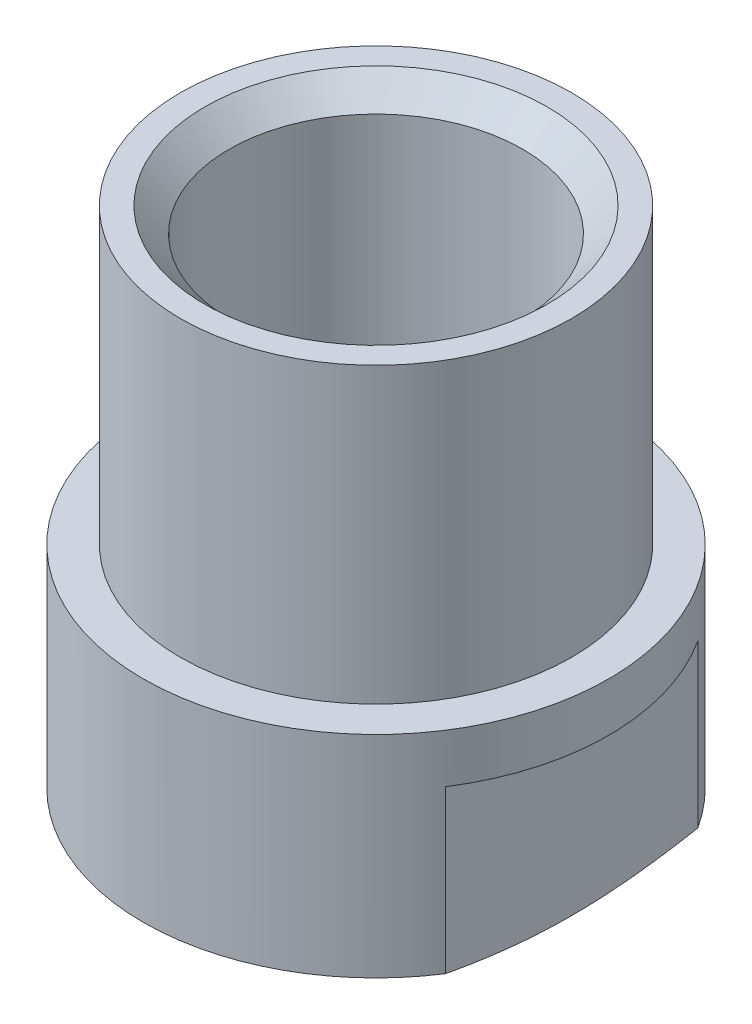
ISO-10303-21;
HEADER;
FILE_DESCRIPTION(('STEP AP214'),'2;1');
FILE_NAME('part.step','',(''),(''),'','','');
FILE_SCHEMA(('AUTOMOTIVE_DESIGN { 1 0 10303 214 1 1 1 1 }'));
ENDSEC;
DATA;
#1=APPLICATION_CONTEXT('core data for automotive mechanical design processes');
#2=APPLICATION_PROTOCOL_DEFINITION('international standard','automotive_design',2000,#1);
#3=PRODUCT_CONTEXT('',#1,'mechanical');
#4=PRODUCT('Part','Part','',(#3));
#5=PRODUCT_RELATED_PRODUCT_CATEGORY('part','',(#4));
#6=PRODUCT_DEFINITION_FORMATION('','',#4);
#7=PRODUCT_DEFINITION_CONTEXT('part definition',#1,'design');
#8=PRODUCT_DEFINITION('design','',#6,#7);
#9=PRODUCT_DEFINITION_SHAPE('','',#8);
#10=(LENGTH_UNIT() NAMED_UNIT(*) SI_UNIT(.MILLI.,.METRE.));
#11=(NAMED_UNIT(*) PLANE_ANGLE_UNIT() SI_UNIT($,.RADIAN.));
#12=(NAMED_UNIT(*) SI_UNIT($,.STERADIAN.) SOLID_ANGLE_UNIT());
#13=UNCERTAINTY_MEASURE_WITH_UNIT(LENGTH_MEASURE(1.E-05),#10,'distance_accuracy_value','');
#14=(GEOMETRIC_REPRESENTATION_CONTEXT(3) GLOBAL_UNCERTAINTY_ASSIGNED_CONTEXT((#13)) GLOBAL_UNIT_ASSIGNED_CONTEXT((#10,
#11,#12)) REPRESENTATION_CONTEXT('',''));
#15=CARTESIAN_POINT('',(0.,0.,0.));
#16=DIRECTION('',(0.,0.,1.));
#17=DIRECTION('',(1.,0.,0.));
#18=AXIS2_PLACEMENT_3D('',#15,#16,#17);
#19=CARTESIAN_POINT('',(0.,26.236559139785,0.));
#20=DIRECTION('',(0.,1.,0.));
#21=DIRECTION('',(0.,0.,1.));
#22=AXIS2_PLACEMENT_3D('',#19,#20,#21);
#23=CYLINDRICAL_SURFACE('',#22,4.76);
#24=CARTESIAN_POINT('',(0.,5.,0.));
#25=DIRECTION('',(0.,1.,0.));
#26=DIRECTION('',(0.,0.,1.));
#27=AXIS2_PLACEMENT_3D('',#24,#25,#26);
#28=CIRCLE('',#27,4.76);
#29=CARTESIAN_POINT('',(0.,5.,4.76));
#30=VERTEX_POINT('',#29);
#31=EDGE_CURVE('E171',#30,#30,#28,.T.);
#32=ORIENTED_EDGE('',*,*,#31,.F.);
#33=EDGE_LOOP('',(#32));
#34=FACE_BOUND('',#33,.T.);
#35=DIRECTION('',(0.,1.,0.));
#36=VECTOR('',#35,1.);
#37=CARTESIAN_POINT('',(4.,26.236559139785,-2.58023254765923));
#38=LINE('',#37,#36);
#39=CARTESIAN_POINT('',(4.,0.688655226579332,-2.58023254765923));
#40=VERTEX_POINT('',#39);
#41=CARTESIAN_POINT('',(4.,4.,-2.58023254765923));
#42=VERTEX_POINT('',#41);
#43=EDGE_CURVE('E212',#40,#42,#38,.T.);
#44=ORIENTED_EDGE('',*,*,#43,.F.);
#45=CARTESIAN_POINT('',(0.,0.688655226579332,0.));
#46=DIRECTION('',(0.,1.,0.));
#47=DIRECTION('',(0.,0.,1.));
#48=AXIS2_PLACEMENT_3D('',#45,#46,#47);
#49=CIRCLE('',#48,4.76);
#50=CARTESIAN_POINT('',(-4.,0.688655226579332,-2.58023254765923));
#51=VERTEX_POINT('',#50);
#52=EDGE_CURVE('E176',#40,#51,#49,.T.);
#53=ORIENTED_EDGE('',*,*,#52,.T.);
#54=DIRECTION('',(0.,1.,0.));
#55=VECTOR('',#54,1.);
#56=CARTESIAN_POINT('',(-4.,26.236559139785,-2.58023254765923));
#57=LINE('',#56,#55);
#58=CARTESIAN_POINT('',(-4.,4.,-2.58023254765923));
#59=VERTEX_POINT('',#58);
#60=EDGE_CURVE('E65',#59,#51,#57,.F.);
#61=ORIENTED_EDGE('',*,*,#60,.F.);
#62=CARTESIAN_POINT('',(0.,4.,0.));
#63=DIRECTION('',(0.,-1.,0.));
#64=DIRECTION('',(0.,0.,-1.));
#65=AXIS2_PLACEMENT_3D('',#62,#63,#64);
#66=CIRCLE('',#65,4.76);
#67=CARTESIAN_POINT('',(-4.,4.,2.58023254765923));
#68=VERTEX_POINT('',#67);
#69=EDGE_CURVE('E54',#68,#59,#66,.T.);
#70=ORIENTED_EDGE('',*,*,#69,.F.);
#71=DIRECTION('',(0.,1.,0.));
#72=VECTOR('',#71,1.);
#73=CARTESIAN_POINT('',(-4.,26.236559139785,2.58023254765923));
#74=LINE('',#73,#72);
#75=CARTESIAN_POINT('',(-4.,0.688655226579331,2.58023254765923));
#76=VERTEX_POINT('',#75);
#77=EDGE_CURVE('E90',#76,#68,#74,.T.);
#78=ORIENTED_EDGE('',*,*,#77,.F.);
#79=CARTESIAN_POINT('',(4.,0.688655226579332,2.58023254765923));
#80=VERTEX_POINT('',#79);
#81=EDGE_CURVE('E173',#76,#80,#49,.T.);
#82=ORIENTED_EDGE('',*,*,#81,.T.);
#83=DIRECTION('',(0.,1.,0.));
#84=VECTOR('',#83,1.);
#85=CARTESIAN_POINT('',(4.,26.236559139785,2.58023254765923));
#86=LINE('',#85,#84);
#87=CARTESIAN_POINT('',(4.,4.,2.58023254765923));
#88=VERTEX_POINT('',#87);
#89=EDGE_CURVE('E73',#88,#80,#86,.F.);
#90=ORIENTED_EDGE('',*,*,#89,.F.);
#91=EDGE_CURVE('E14',#42,#88,#66,.T.);
#92=ORIENTED_EDGE('',*,*,#91,.F.);
#93=EDGE_LOOP('',(#44,#53,#61,#70,#78,#82,#90,#92));
#94=FACE_BOUND('',#93,.T.);
#95=ADVANCED_FACE('F50',(#34,#94),#23,.T.);
#96=CARTESIAN_POINT('',(0.,0.688655226579332,0.));
#97=DIRECTION('',(0.,1.,0.));
#98=DIRECTION('',(0.,0.,1.));
#99=AXIS2_PLACEMENT_3D('',#96,#97,#98);
#100=CONICAL_SURFACE('',#99,4.76,1.23918376891598);
#101=CARTESIAN_POINT('',(0.,0.,0.));
#102=DIRECTION('',(0.,1.,0.));
#103=DIRECTION('',(0.,0.,1.));
#104=AXIS2_PLACEMENT_3D('',#101,#102,#103);
#105=CIRCLE('',#104,2.75999999999998);
#106=CARTESIAN_POINT('',(0.,0.,2.75999999999998));
#107=VERTEX_POINT('',#106);
#108=EDGE_CURVE('E183',#107,#107,#105,.F.);
#109=ORIENTED_EDGE('',*,*,#108,.F.);
#110=EDGE_LOOP('',(#109));
#111=FACE_BOUND('',#110,.T.);
#112=ORIENTED_EDGE('',*,*,#52,.F.);
#113=CARTESIAN_POINT('',(4.,2.06856526032756,-7.80191824309766));
#114=CARTESIAN_POINT('',(4.,2.00614772294494,-7.59817257614237));
#115=CARTESIAN_POINT('',(4.,1.94417572215278,-7.39428887534418));
#116=CARTESIAN_POINT('',(4.,1.82136768043107,-6.98617362148704));
#117=CARTESIAN_POINT('',(4.,1.76053167156944,-6.78194205878535));
#118=CARTESIAN_POINT('',(4.,1.6402666746478,-6.37314768927128));
#119=CARTESIAN_POINT('',(4.,1.58083716583819,-6.16858503599073));
#120=CARTESIAN_POINT('',(4.,1.46370103873259,-5.75896699355474));
#121=CARTESIAN_POINT('',(4.,1.40599441213063,-5.5539116067799));
#122=CARTESIAN_POINT('',(4.,1.29336402776846,-5.1454531461038));
#123=CARTESIAN_POINT('',(4.,1.23841670377829,-4.9420565903151));
#124=CARTESIAN_POINT('',(4.,1.13119948866583,-4.53455981557616));
#125=CARTESIAN_POINT('',(4.,1.07892955162818,-4.33045960875716));
#126=CARTESIAN_POINT('',(4.,0.977751687401888,-3.92119944514491));
#127=CARTESIAN_POINT('',(4.,0.92884728067224,-3.71603861294565));
#128=CARTESIAN_POINT('',(4.,0.835425470779113,-3.30470968484936));
#129=CARTESIAN_POINT('',(4.,0.790908128852577,-3.09854157493436));
#130=CARTESIAN_POINT('',(4.,0.706924783966465,-2.68223276843501));
#131=CARTESIAN_POINT('',(4.,0.667536129627278,-2.47207628713711));
#132=CARTESIAN_POINT('',(4.,0.596101440462887,-2.05050153814573));
#133=CARTESIAN_POINT('',(4.,0.564055338501905,-1.83908328200727));
#134=CARTESIAN_POINT('',(4.,0.509109102446777,-1.41553123076623));
#135=CARTESIAN_POINT('',(4.,0.486188116843271,-1.20340019705015));
#136=CARTESIAN_POINT('',(4.,0.450995806246987,-0.778248953447349));
#137=CARTESIAN_POINT('',(4.,0.438723740991809,-0.565228806402154));
#138=CARTESIAN_POINT('',(4.,0.425804381394138,-0.137124916369404));
#139=CARTESIAN_POINT('',(4.,0.42525054564611,0.0779617389053911));
#140=CARTESIAN_POINT('',(4.,0.436056849937464,0.507829744412112));
#141=CARTESIAN_POINT('',(4.,0.447417264267568,0.722611087501125));
#142=CARTESIAN_POINT('',(4.,0.481115169128206,1.15179639138233));
#143=CARTESIAN_POINT('',(4.,0.503478104402116,1.3661983156915));
#144=CARTESIAN_POINT('',(4.,0.544039828045698,1.68688314476969));
#145=CARTESIAN_POINT('',(4.,0.558730473065418,1.79362809759594));
#146=CARTESIAN_POINT('',(4.,0.590229278337989,2.00680417448271));
#147=CARTESIAN_POINT('',(4.,0.607037409493095,2.11323530283513));
#148=CARTESIAN_POINT('',(4.,0.685176695707635,2.58103680862678));
#149=CARTESIAN_POINT('',(4.,0.756481716577506,2.94074700982064));
#150=CARTESIAN_POINT('',(4.,0.913409253760065,3.6570556553806));
#151=CARTESIAN_POINT('',(4.,0.999037859785069,4.01365270804446));
#152=CARTESIAN_POINT('',(4.,1.17968452558381,4.72491280893463));
#153=CARTESIAN_POINT('',(4.,1.27471417758511,5.07957288579619));
#154=CARTESIAN_POINT('',(4.,1.47091176446641,5.78710596137791));
#155=CARTESIAN_POINT('',(4.,1.57207862729051,6.13997926061323));
#156=CARTESIAN_POINT('',(4.,1.77899381596366,6.84579166376166));
#157=CARTESIAN_POINT('',(4.,1.88475769839422,7.19872618686029));
#158=CARTESIAN_POINT('',(4.,2.099265514671,7.90369947293349));
#159=CARTESIAN_POINT('',(4.,2.2080095591164,8.25573820213224));
#160=CARTESIAN_POINT('',(4.,2.42757110932614,8.95887895209185));
#161=CARTESIAN_POINT('',(4.,2.53838700819606,9.30998147564368));
#162=CARTESIAN_POINT('',(4.,2.76162469012769,10.0116760757236));
#163=CARTESIAN_POINT('',(4.,2.87404647843865,10.3622681505791));
#164=CARTESIAN_POINT('',(4.,3.20777346725577,11.3968773684255));
#165=CARTESIAN_POINT('',(4.,3.43077632096387,12.0803464997107));
#166=CARTESIAN_POINT('',(4.,3.87967147013433,13.4465097045662));
#167=CARTESIAN_POINT('',(4.,4.10556443083368,14.1292035588305));
#168=CARTESIAN_POINT('',(4.,4.55756318214038,15.4889454820566));
#169=CARTESIAN_POINT('',(4.,4.7836551827379,16.1659981388572));
#170=CARTESIAN_POINT('',(4.,5.2371132141797,17.5194925728064));
#171=CARTESIAN_POINT('',(4.,5.46447891968577,18.1959344589057));
#172=CARTESIAN_POINT('',(4.,5.69224705954503,18.8722395459793));
#173=B_SPLINE_CURVE_WITH_KNOTS('',3,(#113,#114,#115,#116,#117,#118,#119,#120,#121,#122,#123,
#124,#125,#126,#127,#128,#129,#130,#131,#132,#133,#134,#135,#136,#137,#138,#139,#140,#141,#142,
#143,#144,#145,#146,#147,#148,#149,#150,#151,#152,#153,#154,#155,#156,#157,#158,#159,#160,#161,
#162,#163,#164,#165,#166,#167,#168,#169,#170,#171,#172),.UNSPECIFIED.,.F.,.F.,(4,2,2,2,2,2,2,2,
2,2,2,2,2,2,2,2,2,2,2,2,2,2,2,2,2,2,2,2,2,4),(0.,0.639278019586059,1.27857405814796,
1.91762957556203,2.55668201161299,3.18873135920881,3.82076986396226,4.45345975740892,
5.08615848102113,5.72750396649789,6.36884358767258,7.0087091748928,7.64853027813021,
8.29345235980157,8.93838928924142,9.58482477909505,9.90806088949848,10.2312925585902,
11.3308747312264,12.4309255880551,13.5323502142489,14.6335829931035,15.7388875012631,
16.8442330849648,17.9487542912502,19.0532791087659,21.2100571002352,23.3673407987344,
25.5087547870995,27.6496447017939),.UNSPECIFIED.);
#174=EDGE_CURVE('E106',#40,#80,#173,.T.);
#175=ORIENTED_EDGE('',*,*,#174,.T.);
#176=ORIENTED_EDGE('',*,*,#81,.F.);
#177=CARTESIAN_POINT('',(-4.,2.06856526032756,-7.80191824309766));
#178=CARTESIAN_POINT('',(-4.,2.00614772294494,-7.59817257614237));
#179=CARTESIAN_POINT('',(-4.,1.94417572215278,-7.39428887534418));
#180=CARTESIAN_POINT('',(-4.,1.82136768043107,-6.98617362148704));
#181=CARTESIAN_POINT('',(-4.,1.76053167156944,-6.78194205878535));
#182=CARTESIAN_POINT('',(-4.,1.6402666746478,-6.37314768927128));
#183=CARTESIAN_POINT('',(-4.,1.58083716583819,-6.16858503599073));
#184=CARTESIAN_POINT('',(-4.,1.46370103873259,-5.75896699355474));
#185=CARTESIAN_POINT('',(-4.,1.40599441213063,-5.5539116067799));
#186=CARTESIAN_POINT('',(-4.,1.29336402776846,-5.1454531461038));
#187=CARTESIAN_POINT('',(-4.,1.23841670377829,-4.9420565903151));
#188=CARTESIAN_POINT('',(-4.,1.13119948866583,-4.53455981557616));
#189=CARTESIAN_POINT('',(-4.,1.07892955162818,-4.33045960875716));
#190=CARTESIAN_POINT('',(-4.,0.977751687401888,-3.92119944514491));
#191=CARTESIAN_POINT('',(-4.,0.92884728067224,-3.71603861294565));
#192=CARTESIAN_POINT('',(-4.,0.835425470779113,-3.30470968484936));
#193=CARTESIAN_POINT('',(-4.,0.790908128852577,-3.09854157493436));
#194=CARTESIAN_POINT('',(-4.,0.706924783966465,-2.68223276843501));
#195=CARTESIAN_POINT('',(-4.,0.667536129627278,-2.47207628713711));
#196=CARTESIAN_POINT('',(-4.,0.596101440462887,-2.05050153814573));
#197=CARTESIAN_POINT('',(-4.,0.564055338501905,-1.83908328200727));
#198=CARTESIAN_POINT('',(-4.,0.509109102446777,-1.41553123076623));
#199=CARTESIAN_POINT('',(-4.,0.486188116843271,-1.20340019705015));
#200=CARTESIAN_POINT('',(-4.,0.450995806246987,-0.778248953447349));
#201=CARTESIAN_POINT('',(-4.,0.438723740991809,-0.565228806402154));
#202=CARTESIAN_POINT('',(-4.,0.425804381394138,-0.137124916369404));
#203=CARTESIAN_POINT('',(-4.,0.42525054564611,0.0779617389053911));
#204=CARTESIAN_POINT('',(-4.,0.436056849937464,0.507829744412112));
#205=CARTESIAN_POINT('',(-4.,0.447417264267568,0.722611087501125));
#206=CARTESIAN_POINT('',(-4.,0.481115169128206,1.15179639138233));
#207=CARTESIAN_POINT('',(-4.,0.503478104402116,1.3661983156915));
#208=CARTESIAN_POINT('',(-4.,0.544039828045698,1.68688314476969));
#209=CARTESIAN_POINT('',(-4.,0.558730473065418,1.79362809759594));
#210=CARTESIAN_POINT('',(-4.,0.590229278337989,2.00680417448271));
#211=CARTESIAN_POINT('',(-4.,0.607037409493095,2.11323530283513));
#212=CARTESIAN_POINT('',(-4.,0.685176695707635,2.58103680862678));
#213=CARTESIAN_POINT('',(-4.,0.756481716577506,2.94074700982064));
#214=CARTESIAN_POINT('',(-4.,0.913409253760065,3.6570556553806));
#215=CARTESIAN_POINT('',(-4.,0.999037859785069,4.01365270804446));
#216=CARTESIAN_POINT('',(-4.,1.17968452558381,4.72491280893463));
#217=CARTESIAN_POINT('',(-4.,1.27471417758511,5.07957288579619));
#218=CARTESIAN_POINT('',(-4.,1.47091176446641,5.78710596137791));
#219=CARTESIAN_POINT('',(-4.,1.57207862729051,6.13997926061323));
#220=CARTESIAN_POINT('',(-4.,1.77899381596366,6.84579166376166));
#221=CARTESIAN_POINT('',(-4.,1.88475769839422,7.19872618686029));
#222=CARTESIAN_POINT('',(-4.,2.099265514671,7.90369947293349));
#223=CARTESIAN_POINT('',(-4.,2.2080095591164,8.25573820213224));
#224=CARTESIAN_POINT('',(-4.,2.42757110932614,8.95887895209185));
#225=CARTESIAN_POINT('',(-4.,2.53838700819606,9.30998147564368));
#226=CARTESIAN_POINT('',(-4.,2.76162469012769,10.0116760757236));
#227=CARTESIAN_POINT('',(-4.,2.87404647843865,10.3622681505791));
#228=CARTESIAN_POINT('',(-4.,3.20777346725577,11.3968773684255));
#229=CARTESIAN_POINT('',(-4.,3.43077632096387,12.0803464997107));
#230=CARTESIAN_POINT('',(-4.,3.87967147013433,13.4465097045662));
#231=CARTESIAN_POINT('',(-4.,4.10556443083368,14.1292035588305));
#232=CARTESIAN_POINT('',(-4.,4.55756318214038,15.4889454820566));
#233=CARTESIAN_POINT('',(-4.,4.7836551827379,16.1659981388572));
#234=CARTESIAN_POINT('',(-4.,5.2371132141797,17.5194925728064));
#235=CARTESIAN_POINT('',(-4.,5.46447891968577,18.1959344589057));
#236=CARTESIAN_POINT('',(-4.,5.69224705954503,18.8722395459793));
#237=B_SPLINE_CURVE_WITH_KNOTS('',3,(#177,#178,#179,#180,#181,#182,#183,#184,#185,#186,#187,
#188,#189,#190,#191,#192,#193,#194,#195,#196,#197,#198,#199,#200,#201,#202,#203,#204,#205,#206,
#207,#208,#209,#210,#211,#212,#213,#214,#215,#216,#217,#218,#219,#220,#221,#222,#223,#224,#225,
#226,#227,#228,#229,#230,#231,#232,#233,#234,#235,#236),.UNSPECIFIED.,.F.,.F.,(4,2,2,2,2,2,2,2,
2,2,2,2,2,2,2,2,2,2,2,2,2,2,2,2,2,2,2,2,2,4),(0.,0.639278019586059,1.27857405814796,
1.91762957556203,2.55668201161299,3.18873135920881,3.82076986396226,4.45345975740892,
5.08615848102113,5.72750396649789,6.36884358767258,7.0087091748928,7.64853027813021,
8.29345235980157,8.93838928924142,9.58482477909505,9.90806088949848,10.2312925585902,
11.3308747312264,12.4309255880551,13.5323502142489,14.6335829931035,15.7388875012631,
16.8442330849648,17.9487542912502,19.0532791087659,21.2100571002352,23.3673407987344,
25.5087547870995,27.6496447017939),.UNSPECIFIED.);
#238=EDGE_CURVE('E94',#76,#51,#237,.F.);
#239=ORIENTED_EDGE('',*,*,#238,.T.);
#240=EDGE_LOOP('',(#112,#175,#176,#239));
#241=FACE_BOUND('',#240,.T.);
#242=ADVANCED_FACE('F120',(#111,#241),#100,.T.);
#243=CARTESIAN_POINT('',(4.76,5.,0.));
#244=DIRECTION('',(0.,-1.,0.));
#245=DIRECTION('',(0.,0.,-1.));
#246=AXIS2_PLACEMENT_3D('',#243,#244,#245);
#247=PLANE('',#246);
#248=CARTESIAN_POINT('',(0.,5.,0.));
#249=DIRECTION('',(0.,1.,0.));
#250=DIRECTION('',(0.,0.,1.));
#251=AXIS2_PLACEMENT_3D('',#248,#249,#250);
#252=CIRCLE('',#251,4.);
#253=CARTESIAN_POINT('',(0.,5.,4.));
#254=VERTEX_POINT('',#253);
#255=EDGE_CURVE('E174',#254,#254,#252,.T.);
#256=ORIENTED_EDGE('',*,*,#255,.F.);
#257=EDGE_LOOP('',(#256));
#258=FACE_BOUND('',#257,.T.);
#259=ORIENTED_EDGE('',*,*,#31,.T.);
#260=EDGE_LOOP('',(#259));
#261=FACE_BOUND('',#260,.T.);
#262=ADVANCED_FACE('F159',(#258,#261),#247,.F.);
#263=CARTESIAN_POINT('',(0.,26.236559139785,0.));
#264=DIRECTION('',(0.,1.,0.));
#265=DIRECTION('',(0.,0.,1.));
#266=AXIS2_PLACEMENT_3D('',#263,#264,#265);
#267=CYLINDRICAL_SURFACE('',#266,4.);
#268=CARTESIAN_POINT('',(0.,11.,0.));
#269=DIRECTION('',(0.,1.,0.));
#270=DIRECTION('',(0.,0.,1.));
#271=AXIS2_PLACEMENT_3D('',#268,#269,#270);
#272=CIRCLE('',#271,4.);
#273=CARTESIAN_POINT('',(0.,11.,4.));
#274=VERTEX_POINT('',#273);
#275=EDGE_CURVE('E179',#274,#274,#272,.T.);
#276=ORIENTED_EDGE('',*,*,#275,.F.);
#277=EDGE_LOOP('',(#276));
#278=FACE_BOUND('',#277,.T.);
#279=ORIENTED_EDGE('',*,*,#255,.T.);
#280=EDGE_LOOP('',(#279));
#281=FACE_BOUND('',#280,.T.);
#282=ADVANCED_FACE('F155',(#278,#281),#267,.T.);
#283=CARTESIAN_POINT('',(4.,11.,0.));
#284=DIRECTION('',(0.,-1.,0.));
#285=DIRECTION('',(0.,0.,-1.));
#286=AXIS2_PLACEMENT_3D('',#283,#284,#285);
#287=PLANE('',#286);
#288=CARTESIAN_POINT('',(0.,11.,0.));
#289=DIRECTION('',(0.,-1.,0.));
#290=DIRECTION('',(0.,0.,-1.));
#291=AXIS2_PLACEMENT_3D('',#288,#289,#290);
#292=CIRCLE('',#291,3.50000000000001);
#293=CARTESIAN_POINT('',(0.,11.,-3.50000000000001));
#294=VERTEX_POINT('',#293);
#295=EDGE_CURVE('E109',#294,#294,#292,.T.);
#296=ORIENTED_EDGE('',*,*,#295,.T.);
#297=EDGE_LOOP('',(#296));
#298=FACE_BOUND('',#297,.T.);
#299=ORIENTED_EDGE('',*,*,#275,.T.);
#300=EDGE_LOOP('',(#299));
#301=FACE_BOUND('',#300,.T.);
#302=ADVANCED_FACE('F151',(#298,#301),#287,.F.);
#303=CARTESIAN_POINT('',(0.,26.236559139785,0.));
#304=DIRECTION('',(0.,1.,0.));
#305=DIRECTION('',(0.,0.,1.));
#306=AXIS2_PLACEMENT_3D('',#303,#304,#305);
#307=CYLINDRICAL_SURFACE('',#306,3.);
#308=CARTESIAN_POINT('',(0.,10.5,0.));
#309=DIRECTION('',(0.,-1.,0.));
#310=DIRECTION('',(0.,0.,-1.));
#311=AXIS2_PLACEMENT_3D('',#308,#309,#310);
#312=CIRCLE('',#311,3.);
#313=CARTESIAN_POINT('',(0.,10.5,-3.));
#314=VERTEX_POINT('',#313);
#315=EDGE_CURVE('E186',#314,#314,#312,.F.);
#316=ORIENTED_EDGE('',*,*,#315,.T.);
#317=EDGE_LOOP('',(#316));
#318=FACE_BOUND('',#317,.T.);
#319=CARTESIAN_POINT('',(0.,1.,0.));
#320=DIRECTION('',(0.,1.,0.));
#321=DIRECTION('',(0.,0.,1.));
#322=AXIS2_PLACEMENT_3D('',#319,#320,#321);
#323=CIRCLE('',#322,3.);
#324=CARTESIAN_POINT('',(0.,1.,3.));
#325=VERTEX_POINT('',#324);
#326=EDGE_CURVE('E198',#325,#325,#323,.T.);
#327=ORIENTED_EDGE('',*,*,#326,.F.);
#328=EDGE_LOOP('',(#327));
#329=FACE_BOUND('',#328,.T.);
#330=ADVANCED_FACE('F147',(#318,#329),#307,.F.);
#331=CARTESIAN_POINT('',(3.,1.,0.));
#332=DIRECTION('',(0.,-1.,0.));
#333=DIRECTION('',(0.,0.,-1.));
#334=AXIS2_PLACEMENT_3D('',#331,#332,#333);
#335=PLANE('',#334);
#336=CARTESIAN_POINT('',(0.,1.,0.));
#337=DIRECTION('',(0.,1.,0.));
#338=DIRECTION('',(0.,0.,1.));
#339=AXIS2_PLACEMENT_3D('',#336,#337,#338);
#340=CIRCLE('',#339,1.5);
#341=CARTESIAN_POINT('',(0.,1.,1.5));
#342=VERTEX_POINT('',#341);
#343=EDGE_CURVE('E200',#342,#342,#340,.T.);
#344=ORIENTED_EDGE('',*,*,#343,.F.);
#345=EDGE_LOOP('',(#344));
#346=FACE_BOUND('',#345,.T.);
#347=ORIENTED_EDGE('',*,*,#326,.T.);
#348=EDGE_LOOP('',(#347));
#349=FACE_BOUND('',#348,.T.);
#350=ADVANCED_FACE('F143',(#346,#349),#335,.F.);
#351=CARTESIAN_POINT('',(0.,26.236559139785,0.));
#352=DIRECTION('',(0.,1.,0.));
#353=DIRECTION('',(0.,0.,1.));
#354=AXIS2_PLACEMENT_3D('',#351,#352,#353);
#355=CYLINDRICAL_SURFACE('',#354,1.5);
#356=CARTESIAN_POINT('',(0.,0.799999999999999,0.));
#357=DIRECTION('',(0.,1.,0.));
#358=DIRECTION('',(0.,0.,1.));
#359=AXIS2_PLACEMENT_3D('',#356,#357,#358);
#360=CIRCLE('',#359,1.5);
#361=CARTESIAN_POINT('',(0.,0.799999999999999,1.5));
#362=VERTEX_POINT('',#361);
#363=EDGE_CURVE('E204',#362,#362,#360,.T.);
#364=ORIENTED_EDGE('',*,*,#363,.F.);
#365=EDGE_LOOP('',(#364));
#366=FACE_BOUND('',#365,.T.);
#367=ORIENTED_EDGE('',*,*,#343,.T.);
#368=EDGE_LOOP('',(#367));
#369=FACE_BOUND('',#368,.T.);
#370=ADVANCED_FACE('F139',(#366,#369),#355,.F.);
#371=CARTESIAN_POINT('',(0.,0.799999999999999,0.));
#372=DIRECTION('',(0.,-1.,0.));
#373=DIRECTION('',(0.,0.,-1.));
#374=AXIS2_PLACEMENT_3D('',#371,#372,#373);
#375=CONICAL_SURFACE('',#374,1.5,0.785398163397449);
#376=CARTESIAN_POINT('',(0.,0.,0.));
#377=DIRECTION('',(0.,1.,0.));
#378=DIRECTION('',(0.,0.,1.));
#379=AXIS2_PLACEMENT_3D('',#376,#377,#378);
#380=CIRCLE('',#379,2.3);
#381=CARTESIAN_POINT('',(0.,0.,2.3));
#382=VERTEX_POINT('',#381);
#383=EDGE_CURVE('E209',#382,#382,#380,.T.);
#384=ORIENTED_EDGE('',*,*,#383,.F.);
#385=EDGE_LOOP('',(#384));
#386=FACE_BOUND('',#385,.T.);
#387=ORIENTED_EDGE('',*,*,#363,.T.);
#388=EDGE_LOOP('',(#387));
#389=FACE_BOUND('',#388,.T.);
#390=ADVANCED_FACE('F135',(#386,#389),#375,.F.);
#391=CARTESIAN_POINT('',(2.3,0.,0.));
#392=DIRECTION('',(0.,1.,0.));
#393=DIRECTION('',(0.,0.,1.));
#394=AXIS2_PLACEMENT_3D('',#391,#392,#393);
#395=PLANE('',#394);
#396=ORIENTED_EDGE('',*,*,#108,.T.);
#397=EDGE_LOOP('',(#396));
#398=FACE_BOUND('',#397,.T.);
#399=ORIENTED_EDGE('',*,*,#383,.T.);
#400=EDGE_LOOP('',(#399));
#401=FACE_BOUND('',#400,.T.);
#402=ADVANCED_FACE('F132',(#398,#401),#395,.F.);
#403=CARTESIAN_POINT('',(0.,10.5,0.));
#404=DIRECTION('',(0.,1.,0.));
#405=DIRECTION('',(0.,0.,1.));
#406=AXIS2_PLACEMENT_3D('',#403,#404,#405);
#407=CONICAL_SURFACE('',#406,3.,0.785398163397452);
#408=ORIENTED_EDGE('',*,*,#295,.F.);
#409=EDGE_LOOP('',(#408));
#410=FACE_BOUND('',#409,.T.);
#411=ORIENTED_EDGE('',*,*,#315,.F.);
#412=EDGE_LOOP('',(#411));
#413=FACE_BOUND('',#412,.T.);
#414=ADVANCED_FACE('F52',(#410,#413),#407,.F.);
#415=CARTESIAN_POINT('',(-4.,4.,-6.));
#416=DIRECTION('',(-1.,0.,0.));
#417=DIRECTION('',(0.,0.,1.));
#418=AXIS2_PLACEMENT_3D('',#415,#416,#417);
#419=PLANE('',#418);
#420=ORIENTED_EDGE('',*,*,#77,.T.);
#421=DIRECTION('',(0.,0.,-1.));
#422=VECTOR('',#421,1.);
#423=CARTESIAN_POINT('',(-4.,4.,-6.));
#424=LINE('',#423,#422);
#425=EDGE_CURVE('E93',#68,#59,#424,.T.);
#426=ORIENTED_EDGE('',*,*,#425,.T.);
#427=ORIENTED_EDGE('',*,*,#60,.T.);
#428=ORIENTED_EDGE('',*,*,#238,.F.);
#429=EDGE_LOOP('',(#420,#426,#427,#428));
#430=FACE_BOUND('',#429,.T.);
#431=ADVANCED_FACE('F92',(#430),#419,.T.);
#432=CARTESIAN_POINT('',(0.,4.,0.));
#433=DIRECTION('',(0.,-1.,0.));
#434=DIRECTION('',(0.,0.,-1.));
#435=AXIS2_PLACEMENT_3D('',#432,#433,#434);
#436=PLANE('',#435);
#437=ORIENTED_EDGE('',*,*,#69,.T.);
#438=ORIENTED_EDGE('',*,*,#425,.F.);
#439=EDGE_LOOP('',(#437,#438));
#440=FACE_BOUND('',#439,.T.);
#441=ADVANCED_FACE('F101',(#440),#436,.T.);
#442=ORIENTED_EDGE('',*,*,#91,.T.);
#443=DIRECTION('',(0.,0.,1.));
#444=VECTOR('',#443,1.);
#445=CARTESIAN_POINT('',(4.,4.,-6.));
#446=LINE('',#445,#444);
#447=EDGE_CURVE('E102',#42,#88,#446,.T.);
#448=ORIENTED_EDGE('',*,*,#447,.F.);
#449=EDGE_LOOP('',(#442,#448));
#450=FACE_BOUND('',#449,.T.);
#451=ADVANCED_FACE('F127',(#450),#436,.T.);
#452=CARTESIAN_POINT('',(4.,4.,-6.));
#453=DIRECTION('',(1.,0.,0.));
#454=DIRECTION('',(0.,0.,-1.));
#455=AXIS2_PLACEMENT_3D('',#452,#453,#454);
#456=PLANE('',#455);
#457=ORIENTED_EDGE('',*,*,#43,.T.);
#458=ORIENTED_EDGE('',*,*,#447,.T.);
#459=ORIENTED_EDGE('',*,*,#89,.T.);
#460=ORIENTED_EDGE('',*,*,#174,.F.);
#461=EDGE_LOOP('',(#457,#458,#459,#460));
#462=FACE_BOUND('',#461,.T.);
#463=ADVANCED_FACE('F123',(#462),#456,.T.);
#464=CLOSED_SHELL('',(#95,#242,#262,#282,#302,#330,#350,#370,#390,#402,#414,#431,#441,#451,#463));
#465=MANIFOLD_SOLID_BREP('B2',#464);
#466=ADVANCED_BREP_SHAPE_REPRESENTATION('',(#18,#465),#14);
#467=SHAPE_DEFINITION_REPRESENTATION(#9,#466);
ENDSEC;
END-ISO-10303-21;
